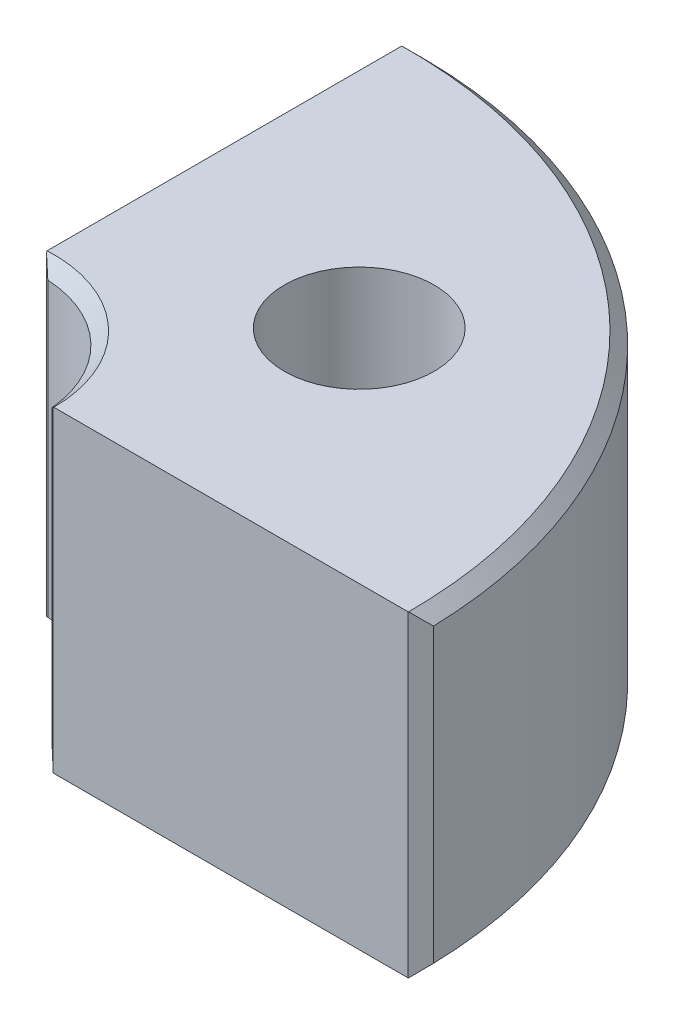
ISO-10303-21;
HEADER;
FILE_DESCRIPTION(('STEP AP214'),'2;1');
FILE_NAME('part.step','',(''),(''),'','','');
FILE_SCHEMA(('AUTOMOTIVE_DESIGN { 1 0 10303 214 1 1 1 1 }'));
ENDSEC;
DATA;
#1=APPLICATION_CONTEXT('core data for automotive mechanical design processes');
#2=APPLICATION_PROTOCOL_DEFINITION('international standard','automotive_design',2000,#1);
#3=PRODUCT_CONTEXT('',#1,'mechanical');
#4=PRODUCT('Part','Part','',(#3));
#5=PRODUCT_RELATED_PRODUCT_CATEGORY('part','',(#4));
#6=PRODUCT_DEFINITION_FORMATION('','',#4);
#7=PRODUCT_DEFINITION_CONTEXT('part definition',#1,'design');
#8=PRODUCT_DEFINITION('design','',#6,#7);
#9=PRODUCT_DEFINITION_SHAPE('','',#8);
#10=(LENGTH_UNIT() NAMED_UNIT(*) SI_UNIT(.MILLI.,.METRE.));
#11=(NAMED_UNIT(*) PLANE_ANGLE_UNIT() SI_UNIT($,.RADIAN.));
#12=(NAMED_UNIT(*) SI_UNIT($,.STERADIAN.) SOLID_ANGLE_UNIT());
#13=UNCERTAINTY_MEASURE_WITH_UNIT(LENGTH_MEASURE(1.E-05),#10,'distance_accuracy_value','');
#14=(GEOMETRIC_REPRESENTATION_CONTEXT(3) GLOBAL_UNCERTAINTY_ASSIGNED_CONTEXT((#13)) GLOBAL_UNIT_ASSIGNED_CONTEXT((#10,
#11,#12)) REPRESENTATION_CONTEXT('',''));
#15=CARTESIAN_POINT('',(0.,0.,0.));
#16=DIRECTION('',(0.,0.,1.));
#17=DIRECTION('',(1.,0.,0.));
#18=AXIS2_PLACEMENT_3D('',#15,#16,#17);
#19=CARTESIAN_POINT('',(0.,-127.,0.));
#20=DIRECTION('',(0.,1.,0.));
#21=DIRECTION('',(0.,0.,1.));
#22=AXIS2_PLACEMENT_3D('',#19,#20,#21);
#23=CYLINDRICAL_SURFACE('',#22,48.);
#24=CARTESIAN_POINT('',(0.,-5.00000000000005,0.));
#25=DIRECTION('',(0.,1.,0.));
#26=DIRECTION('',(0.,0.,1.));
#27=AXIS2_PLACEMENT_3D('',#24,#25,#26);
#28=CIRCLE('',#27,48.);
#29=CARTESIAN_POINT('',(47.7859234714792,-5.00000000000005,-4.5283018867925));
#30=VERTEX_POINT('',#29);
#31=CARTESIAN_POINT('',(2.68257943766785,-5.00000000000005,-47.9249806213899));
#32=VERTEX_POINT('',#31);
#33=EDGE_CURVE('E283',#30,#32,#28,.T.);
#34=ORIENTED_EDGE('',*,*,#33,.T.);
#35=DIRECTION('',(0.,1.,0.));
#36=VECTOR('',#35,1.);
#37=CARTESIAN_POINT('',(2.68257943766785,-127.,-47.9249806213899));
#38=LINE('',#37,#36);
#39=CARTESIAN_POINT('',(2.68257943766785,-122.,-47.9249806213899));
#40=VERTEX_POINT('',#39);
#41=EDGE_CURVE('E289',#32,#40,#38,.F.);
#42=ORIENTED_EDGE('',*,*,#41,.T.);
#43=CARTESIAN_POINT('',(0.,-122.,0.));
#44=DIRECTION('',(0.,1.,0.));
#45=DIRECTION('',(0.,0.,1.));
#46=AXIS2_PLACEMENT_3D('',#43,#44,#45);
#47=CIRCLE('',#46,48.);
#48=CARTESIAN_POINT('',(47.7859234714792,-122.,-4.5283018867925));
#49=VERTEX_POINT('',#48);
#50=EDGE_CURVE('E287',#40,#49,#47,.F.);
#51=ORIENTED_EDGE('',*,*,#50,.T.);
#52=DIRECTION('',(0.,1.,0.));
#53=VECTOR('',#52,1.);
#54=CARTESIAN_POINT('',(47.7859234714792,-127.,-4.5283018867925));
#55=LINE('',#54,#53);
#56=EDGE_CURVE('E285',#49,#30,#55,.T.);
#57=ORIENTED_EDGE('',*,*,#56,.T.);
#58=EDGE_LOOP('',(#34,#42,#51,#57));
#59=FACE_BOUND('',#58,.T.);
#60=ADVANCED_FACE('F35',(#59),#23,.F.);
#61=CARTESIAN_POINT('',(-2.61819612069647,-127.,-199.982861888397));
#62=DIRECTION('',(-1.,0.,0.));
#63=DIRECTION('',(0.,0.,1.));
#64=AXIS2_PLACEMENT_3D('',#61,#62,#63);
#65=PLANE('',#64);
#66=DIRECTION('',(0.,-1.,0.));
#67=VECTOR('',#66,1.);
#68=CARTESIAN_POINT('',(-2.61819612069647,-127.,-194.982861888397));
#69=LINE('',#68,#67);
#70=CARTESIAN_POINT('',(-2.61819612069647,-0.000439438263805103,-194.982861888397));
#71=VERTEX_POINT('',#70);
#72=CARTESIAN_POINT('',(-2.61819612069647,-126.999560561736,-194.982861888397));
#73=VERTEX_POINT('',#72);
#74=EDGE_CURVE('E138',#71,#73,#69,.T.);
#75=ORIENTED_EDGE('',*,*,#74,.T.);
#76=CARTESIAN_POINT('',(-2.61819612069647,-126.999560561736,-194.982861888397));
#77=CARTESIAN_POINT('',(-2.61819612069647,-126.999633801447,-194.982788642083));
#78=CARTESIAN_POINT('',(-2.61819612069647,-126.999707041157,-194.98271539577));
#79=CARTESIAN_POINT('',(-2.61819612069647,-126.999853520579,-194.982568903144));
#80=CARTESIAN_POINT('',(-2.61819612069647,-126.999926760289,-194.982495656831));
#81=CARTESIAN_POINT('',(-2.61819612069647,-127.,-194.982422410518));
#82=B_SPLINE_CURVE_WITH_KNOTS('',3,(#76,#77,#78,#79,#80,#81),.UNSPECIFIED.,.F.,.F.,(4,2,4),(0.,
0.000310743782614105,0.000621487565228213),.UNSPECIFIED.);
#83=CARTESIAN_POINT('',(-2.61819612069647,-127.,-194.982422410518));
#84=VERTEX_POINT('',#83);
#85=EDGE_CURVE('E277',#73,#84,#82,.T.);
#86=ORIENTED_EDGE('',*,*,#85,.T.);
#87=DIRECTION('',(0.,0.,1.));
#88=VECTOR('',#87,1.);
#89=CARTESIAN_POINT('',(-2.61819612069647,-127.,-199.982861888397));
#90=LINE('',#89,#88);
#91=CARTESIAN_POINT('',(-2.61819612069647,-127.,-52.9352911494172));
#92=VERTEX_POINT('',#91);
#93=EDGE_CURVE('E151',#84,#92,#90,.T.);
#94=ORIENTED_EDGE('',*,*,#93,.T.);
#95=CARTESIAN_POINT('',(-2.61819612069647,-127.,-52.9352911494172));
#96=CARTESIAN_POINT('',(-2.61819612069647,-126.956941242904,-52.8921797573179));
#97=CARTESIAN_POINT('',(-2.61819612069647,-126.913882550543,-52.8490683005629));
#98=CARTESIAN_POINT('',(-2.61819612069647,-126.827765295292,-52.7628452577417));
#99=CARTESIAN_POINT('',(-2.61819612069647,-126.784706732401,-52.7197336716754));
#100=CARTESIAN_POINT('',(-2.61819612069647,-126.741648234245,-52.6766220209536));
#101=B_SPLINE_CURVE_WITH_KNOTS('',3,(#95,#96,#97,#98,#99,#100),.UNSPECIFIED.,.F.,.F.,(4,2,4),
(0.,0.18279452459601,0.365589049192035),.UNSPECIFIED.);
#102=CARTESIAN_POINT('',(-2.61819612069647,-126.741648234245,-52.6766220209536));
#103=VERTEX_POINT('',#102);
#104=EDGE_CURVE('E221',#92,#103,#101,.T.);
#105=ORIENTED_EDGE('',*,*,#104,.T.);
#106=DIRECTION('',(0.,1.,0.));
#107=VECTOR('',#106,1.);
#108=CARTESIAN_POINT('',(-2.61819612069647,-127.,-52.6766220209536));
#109=LINE('',#108,#107);
#110=CARTESIAN_POINT('',(-2.61819612069647,-0.258351765754949,-52.6766220209536));
#111=VERTEX_POINT('',#110);
#112=EDGE_CURVE('E159',#103,#111,#109,.T.);
#113=ORIENTED_EDGE('',*,*,#112,.T.);
#114=CARTESIAN_POINT('',(-2.61819612069647,-0.258351765754949,-52.6766220209536));
#115=CARTESIAN_POINT('',(-2.61819612069647,-0.215293267599232,-52.7197336716754));
#116=CARTESIAN_POINT('',(-2.61819612069647,-0.172234704708461,-52.7628452577417));
#117=CARTESIAN_POINT('',(-2.61819612069647,-0.086117449456811,-52.8490683005629));
#118=CARTESIAN_POINT('',(-2.61819612069647,-0.0430587570959324,-52.8921797573179));
#119=CARTESIAN_POINT('',(-2.61819612069647,0.,-52.9352911494172));
#120=B_SPLINE_CURVE_WITH_KNOTS('',3,(#114,#115,#116,#117,#118,#119),.UNSPECIFIED.,.F.,.F.,(4,2,
4),(0.,0.182794524596019,0.365589049192035),.UNSPECIFIED.);
#121=CARTESIAN_POINT('',(-2.61819612069647,0.,-52.9352911494172));
#122=VERTEX_POINT('',#121);
#123=EDGE_CURVE('E157',#111,#122,#120,.T.);
#124=ORIENTED_EDGE('',*,*,#123,.T.);
#125=DIRECTION('',(0.,0.,1.));
#126=VECTOR('',#125,1.);
#127=CARTESIAN_POINT('',(-2.61819612069647,0.,-199.982861888397));
#128=LINE('',#127,#126);
#129=CARTESIAN_POINT('',(-2.61819612069647,0.,-194.982422410518));
#130=VERTEX_POINT('',#129);
#131=EDGE_CURVE('E310',#130,#122,#128,.T.);
#132=ORIENTED_EDGE('',*,*,#131,.F.);
#133=CARTESIAN_POINT('',(-2.61819612069647,0.,-194.982422410518));
#134=CARTESIAN_POINT('',(-2.61819612069647,-7.32397106311979E-05,-194.982495656831));
#135=CARTESIAN_POINT('',(-2.61819612069647,-0.000146479421262396,-194.982568903144));
#136=CARTESIAN_POINT('',(-2.61819612069647,-0.000292958842524792,-194.98271539577));
#137=CARTESIAN_POINT('',(-2.61819612069647,-0.000366198553155989,-194.982788642083));
#138=CARTESIAN_POINT('',(-2.61819612069647,-0.000439438263787187,-194.982861888397));
#139=B_SPLINE_CURVE_WITH_KNOTS('',3,(#133,#134,#135,#136,#137,#138),.UNSPECIFIED.,.F.,.F.,(4,2,
4),(0.,0.000310743782617586,0.000621487565235172),.UNSPECIFIED.);
#140=EDGE_CURVE('E227',#130,#71,#139,.T.);
#141=ORIENTED_EDGE('',*,*,#140,.T.);
#142=EDGE_LOOP('',(#75,#86,#94,#105,#113,#124,#132,#141));
#143=FACE_BOUND('',#142,.T.);
#144=ADVANCED_FACE('F171',(#143),#65,.T.);
#145=CARTESIAN_POINT('',(0.,-127.,0.));
#146=DIRECTION('',(0.,1.,0.));
#147=DIRECTION('',(0.,0.,1.));
#148=AXIS2_PLACEMENT_3D('',#145,#146,#147);
#149=CYLINDRICAL_SURFACE('',#148,200.);
#150=CARTESIAN_POINT('',(0.,-122.,0.));
#151=DIRECTION('',(0.,1.,0.));
#152=DIRECTION('',(0.,0.,1.));
#153=AXIS2_PLACEMENT_3D('',#150,#151,#152);
#154=CIRCLE('',#153,200.);
#155=CARTESIAN_POINT('',(199.93424297044,-122.,-5.12820512820508));
#156=VERTEX_POINT('',#155);
#157=CARTESIAN_POINT('',(2.38472421162988,-122.,-199.985782220723));
#158=VERTEX_POINT('',#157);
#159=EDGE_CURVE('E155',#156,#158,#154,.T.);
#160=ORIENTED_EDGE('',*,*,#159,.T.);
#161=DIRECTION('',(0.,1.,0.));
#162=VECTOR('',#161,1.);
#163=CARTESIAN_POINT('',(2.38472421162988,-127.,-199.985782220723));
#164=LINE('',#163,#162);
#165=CARTESIAN_POINT('',(2.38472421162988,-4.99999999999995,-199.985782220723));
#166=VERTEX_POINT('',#165);
#167=EDGE_CURVE('E136',#158,#166,#164,.T.);
#168=ORIENTED_EDGE('',*,*,#167,.T.);
#169=CARTESIAN_POINT('',(0.,-4.99999999999995,0.));
#170=DIRECTION('',(0.,1.,0.));
#171=DIRECTION('',(0.,0.,1.));
#172=AXIS2_PLACEMENT_3D('',#169,#170,#171);
#173=CIRCLE('',#172,200.);
#174=CARTESIAN_POINT('',(199.93424297044,-4.99999999999995,-5.12820512820508));
#175=VERTEX_POINT('',#174);
#176=EDGE_CURVE('E144',#166,#175,#173,.F.);
#177=ORIENTED_EDGE('',*,*,#176,.T.);
#178=DIRECTION('',(0.,1.,0.));
#179=VECTOR('',#178,1.);
#180=CARTESIAN_POINT('',(199.93424297044,-127.,-5.12820512820508));
#181=LINE('',#180,#179);
#182=EDGE_CURVE('E150',#175,#156,#181,.F.);
#183=ORIENTED_EDGE('',*,*,#182,.T.);
#184=EDGE_LOOP('',(#160,#168,#177,#183));
#185=FACE_BOUND('',#184,.T.);
#186=ADVANCED_FACE('F153',(#185),#149,.T.);
#187=CARTESIAN_POINT('',(48.,-127.,0.));
#188=DIRECTION('',(0.,0.,1.));
#189=DIRECTION('',(1.,0.,0.));
#190=AXIS2_PLACEMENT_3D('',#187,#188,#189);
#191=PLANE('',#190);
#192=DIRECTION('',(1.,0.,0.));
#193=VECTOR('',#192,1.);
#194=CARTESIAN_POINT('',(48.,-127.,0.));
#195=LINE('',#194,#193);
#196=CARTESIAN_POINT('',(53.,-127.,0.));
#197=VERTEX_POINT('',#196);
#198=CARTESIAN_POINT('',(194.935886896179,-127.,0.));
#199=VERTEX_POINT('',#198);
#200=EDGE_CURVE('E315',#197,#199,#195,.T.);
#201=ORIENTED_EDGE('',*,*,#200,.T.);
#202=DIRECTION('',(0.,1.,0.));
#203=VECTOR('',#202,1.);
#204=CARTESIAN_POINT('',(194.935886896179,-127.,0.));
#205=LINE('',#204,#203);
#206=CARTESIAN_POINT('',(194.935886896179,0.,0.));
#207=VERTEX_POINT('',#206);
#208=EDGE_CURVE('E303',#199,#207,#205,.T.);
#209=ORIENTED_EDGE('',*,*,#208,.T.);
#210=DIRECTION('',(1.,0.,0.));
#211=VECTOR('',#210,1.);
#212=CARTESIAN_POINT('',(48.,0.,0.));
#213=LINE('',#212,#211);
#214=CARTESIAN_POINT('',(53.,0.,0.));
#215=VERTEX_POINT('',#214);
#216=EDGE_CURVE('E316',#215,#207,#213,.T.);
#217=ORIENTED_EDGE('',*,*,#216,.F.);
#218=DIRECTION('',(0.707106781186546,0.707106781186549,0.));
#219=VECTOR('',#218,1.);
#220=CARTESIAN_POINT('',(0.,-53.0000000000002,0.));
#221=LINE('',#220,#219);
#222=CARTESIAN_POINT('',(52.7636238330917,-0.236376166908331,0.));
#223=VERTEX_POINT('',#222);
#224=EDGE_CURVE('E298',#215,#223,#221,.F.);
#225=ORIENTED_EDGE('',*,*,#224,.T.);
#226=DIRECTION('',(0.,-1.,0.));
#227=VECTOR('',#226,1.);
#228=CARTESIAN_POINT('',(52.7636238330917,-127.,0.));
#229=LINE('',#228,#227);
#230=CARTESIAN_POINT('',(52.7636238330917,-126.763623833092,0.));
#231=VERTEX_POINT('',#230);
#232=EDGE_CURVE('E64',#223,#231,#229,.T.);
#233=ORIENTED_EDGE('',*,*,#232,.T.);
#234=DIRECTION('',(-0.707106781186546,0.707106781186549,0.));
#235=VECTOR('',#234,1.);
#236=CARTESIAN_POINT('',(0.,-73.9999999999998,0.));
#237=LINE('',#236,#235);
#238=EDGE_CURVE('E301',#231,#197,#237,.F.);
#239=ORIENTED_EDGE('',*,*,#238,.T.);
#240=EDGE_LOOP('',(#201,#209,#217,#225,#233,#239));
#241=FACE_BOUND('',#240,.T.);
#242=ADVANCED_FACE('F353',(#241),#191,.T.);
#243=CARTESIAN_POINT('',(0.,-127.,0.));
#244=DIRECTION('',(0.,1.,0.));
#245=DIRECTION('',(0.,0.,1.));
#246=AXIS2_PLACEMENT_3D('',#243,#244,#245);
#247=PLANE('',#246);
#248=CARTESIAN_POINT('',(86.7388556420205,-127.,-88.5903030924198));
#249=DIRECTION('',(0.,1.,0.));
#250=DIRECTION('',(0.,0.,1.));
#251=AXIS2_PLACEMENT_3D('',#248,#249,#250);
#252=CIRCLE('',#251,30.);
#253=CARTESIAN_POINT('',(86.7388556420205,-127.,-58.5903030924198));
#254=VERTEX_POINT('',#253);
#255=EDGE_CURVE('E320',#254,#254,#252,.T.);
#256=ORIENTED_EDGE('',*,*,#255,.T.);
#257=EDGE_LOOP('',(#256));
#258=FACE_BOUND('',#257,.T.);
#259=ORIENTED_EDGE('',*,*,#93,.F.);
#260=CARTESIAN_POINT('',(0.,-127.,0.));
#261=DIRECTION('',(0.,1.,0.));
#262=DIRECTION('',(0.,0.,1.));
#263=AXIS2_PLACEMENT_3D('',#260,#261,#262);
#264=CIRCLE('',#263,195.);
#265=CARTESIAN_POINT('',(194.999988909397,-127.,-0.0657672778869932));
#266=VERTEX_POINT('',#265);
#267=EDGE_CURVE('E296',#84,#266,#264,.F.);
#268=ORIENTED_EDGE('',*,*,#267,.T.);
#269=DIRECTION('',(0.697982440452114,0.,-0.716114874039432));
#270=VECTOR('',#269,1.);
#271=CARTESIAN_POINT('',(194.935886896179,-127.,0.));
#272=LINE('',#271,#270);
#273=EDGE_CURVE('E294',#266,#199,#272,.F.);
#274=ORIENTED_EDGE('',*,*,#273,.T.);
#275=ORIENTED_EDGE('',*,*,#200,.F.);
#276=CARTESIAN_POINT('',(0.,-127.,0.));
#277=DIRECTION('',(0.,1.,0.));
#278=DIRECTION('',(0.,0.,1.));
#279=AXIS2_PLACEMENT_3D('',#276,#277,#278);
#280=CIRCLE('',#279,53.);
#281=EDGE_CURVE('E292',#197,#92,#280,.T.);
#282=ORIENTED_EDGE('',*,*,#281,.T.);
#283=EDGE_LOOP('',(#259,#268,#274,#275,#282));
#284=FACE_BOUND('',#283,.T.);
#285=ADVANCED_FACE('F333',(#258,#284),#247,.F.);
#286=CARTESIAN_POINT('',(0.,0.,0.));
#287=DIRECTION('',(0.,1.,0.));
#288=DIRECTION('',(0.,0.,1.));
#289=AXIS2_PLACEMENT_3D('',#286,#287,#288);
#290=PLANE('',#289);
#291=CARTESIAN_POINT('',(86.7388556420205,0.,-88.5903030924198));
#292=DIRECTION('',(0.,1.,0.));
#293=DIRECTION('',(0.,0.,1.));
#294=AXIS2_PLACEMENT_3D('',#291,#292,#293);
#295=CIRCLE('',#294,30.);
#296=CARTESIAN_POINT('',(86.7388556420205,0.,-58.5903030924198));
#297=VERTEX_POINT('',#296);
#298=EDGE_CURVE('E268',#297,#297,#295,.T.);
#299=ORIENTED_EDGE('',*,*,#298,.F.);
#300=EDGE_LOOP('',(#299));
#301=FACE_BOUND('',#300,.T.);
#302=ORIENTED_EDGE('',*,*,#216,.T.);
#303=DIRECTION('',(-0.697982440452114,0.,0.716114874039432));
#304=VECTOR('',#303,1.);
#305=CARTESIAN_POINT('',(99.9671214852199,0.,97.4358974358974));
#306=LINE('',#305,#304);
#307=CARTESIAN_POINT('',(194.999988909397,0.,-0.0657672778869648));
#308=VERTEX_POINT('',#307);
#309=EDGE_CURVE('E11',#207,#308,#306,.F.);
#310=ORIENTED_EDGE('',*,*,#309,.T.);
#311=CARTESIAN_POINT('',(0.,0.,0.));
#312=DIRECTION('',(0.,1.,0.));
#313=DIRECTION('',(0.,0.,1.));
#314=AXIS2_PLACEMENT_3D('',#311,#312,#313);
#315=CIRCLE('',#314,195.);
#316=EDGE_CURVE('E50',#308,#130,#315,.T.);
#317=ORIENTED_EDGE('',*,*,#316,.T.);
#318=ORIENTED_EDGE('',*,*,#131,.T.);
#319=CARTESIAN_POINT('',(0.,0.,0.));
#320=DIRECTION('',(0.,1.,0.));
#321=DIRECTION('',(0.,0.,1.));
#322=AXIS2_PLACEMENT_3D('',#319,#320,#321);
#323=CIRCLE('',#322,53.);
#324=EDGE_CURVE('E305',#122,#215,#323,.F.);
#325=ORIENTED_EDGE('',*,*,#324,.T.);
#326=EDGE_LOOP('',(#302,#310,#317,#318,#325));
#327=FACE_BOUND('',#326,.T.);
#328=ADVANCED_FACE('F309',(#301,#327),#290,.T.);
#329=CARTESIAN_POINT('',(86.7388556420205,-127.,-88.5903030924198));
#330=DIRECTION('',(0.,1.,0.));
#331=DIRECTION('',(0.,0.,1.));
#332=AXIS2_PLACEMENT_3D('',#329,#330,#331);
#333=CYLINDRICAL_SURFACE('',#332,30.);
#334=ORIENTED_EDGE('',*,*,#255,.F.);
#335=EDGE_LOOP('',(#334));
#336=FACE_BOUND('',#335,.T.);
#337=ORIENTED_EDGE('',*,*,#298,.T.);
#338=EDGE_LOOP('',(#337));
#339=FACE_BOUND('',#338,.T.);
#340=ADVANCED_FACE('F343',(#336,#339),#333,.F.);
#341=CARTESIAN_POINT('',(194.935886896179,-127.,0.));
#342=DIRECTION('',(-0.716114874039432,0.,-0.697982440452114));
#343=DIRECTION('',(0.,1.,0.));
#344=AXIS2_PLACEMENT_3D('',#341,#342,#343);
#345=PLANE('',#344);
#346=ORIENTED_EDGE('',*,*,#208,.F.);
#347=ORIENTED_EDGE('',*,*,#273,.F.);
#348=CARTESIAN_POINT('',(194.999988909397,-127.,-0.0657672778869932));
#349=CARTESIAN_POINT('',(195.412937033083,-126.586908646135,-0.489443113322181));
#350=CARTESIAN_POINT('',(195.825433210064,-126.172890248044,-0.912655261222494));
#351=CARTESIAN_POINT('',(196.649536606926,-125.3430524616,-1.75816750628351));
#352=CARTESIAN_POINT('',(197.061143834675,-124.927233089284,-2.18046761151571));
#353=CARTESIAN_POINT('',(197.883491469298,-124.093839249565,-3.0241784825269));
#354=CARTESIAN_POINT('',(198.294231876464,-123.676264782754,-3.44558924860592));
#355=CARTESIAN_POINT('',(199.114867639095,-122.839403797579,-4.28754377601261));
#356=CARTESIAN_POINT('',(199.524762987019,-122.420117264034,-4.70808752960235));
#357=CARTESIAN_POINT('',(199.93424297044,-122.,-5.12820512820507));
#358=B_SPLINE_CURVE_WITH_KNOTS('',3,(#348,#349,#350,#351,#352,#353,#354,#355,#356,#357),
.UNSPECIFIED.,.F.,.F.,(4,2,2,2,4),(0.,2.16472666625088,4.32943409568699,6.49414079469575,
8.65886673037086),.UNSPECIFIED.);
#359=EDGE_CURVE('E258',#156,#266,#358,.F.);
#360=ORIENTED_EDGE('',*,*,#359,.F.);
#361=ORIENTED_EDGE('',*,*,#182,.F.);
#362=CARTESIAN_POINT('',(194.999988909397,0.,-0.0657672778869648));
#363=CARTESIAN_POINT('',(195.412937033083,-0.413091353864836,-0.489443113322158));
#364=CARTESIAN_POINT('',(195.825433210064,-0.82710975195554,-0.912655261222477));
#365=CARTESIAN_POINT('',(196.649536606926,-1.65694753839952,-1.7581675062835));
#366=CARTESIAN_POINT('',(197.061143834675,-2.07276691071563,-2.1804676115157));
#367=CARTESIAN_POINT('',(197.883491469298,-2.90616075043525,-3.0241784825269));
#368=CARTESIAN_POINT('',(198.294231876464,-3.32373521724649,-3.44558924860592));
#369=CARTESIAN_POINT('',(199.114867639095,-4.16059620242143,-4.28754377601261));
#370=CARTESIAN_POINT('',(199.524762987019,-4.57988273596629,-4.70808752960236));
#371=CARTESIAN_POINT('',(199.93424297044,-4.99999999999996,-5.12820512820507));
#372=B_SPLINE_CURVE_WITH_KNOTS('',3,(#362,#363,#364,#365,#366,#367,#368,#369,#370,#371),
.UNSPECIFIED.,.F.,.F.,(4,2,2,2,4),(0.,2.16472666625089,4.32943409568702,6.49414079469578,
8.6588667303709),.UNSPECIFIED.);
#373=EDGE_CURVE('E147',#308,#175,#372,.T.);
#374=ORIENTED_EDGE('',*,*,#373,.F.);
#375=ORIENTED_EDGE('',*,*,#309,.F.);
#376=EDGE_LOOP('',(#346,#347,#360,#361,#374,#375));
#377=FACE_BOUND('',#376,.T.);
#378=ADVANCED_FACE('F188',(#377),#345,.F.);
#379=CARTESIAN_POINT('',(0.,-122.,0.));
#380=DIRECTION('',(0.,1.,0.));
#381=DIRECTION('',(0.,0.,1.));
#382=AXIS2_PLACEMENT_3D('',#379,#380,#381);
#383=CONICAL_SURFACE('',#382,200.,0.785398163397451);
#384=ORIENTED_EDGE('',*,*,#267,.F.);
#385=ORIENTED_EDGE('',*,*,#85,.F.);
#386=CARTESIAN_POINT('',(-2.61819612069647,-126.999560561736,-194.982861888397));
#387=CARTESIAN_POINT('',(-2.19949708498547,-126.586520616592,-195.401560924108));
#388=CARTESIAN_POINT('',(-1.78125736543306,-126.172549769697,-195.81980064366));
#389=CARTESIAN_POINT('',(-0.945681398964447,-125.34279963182,-196.655376610129));
#390=CARTESIAN_POINT('',(-0.528345144000101,-124.927020357047,-197.072712865093));
#391=CARTESIAN_POINT('',(0.305446401250749,-124.093699473263,-197.906504410344));
#392=CARTESIAN_POINT('',(0.721901691836459,-123.676157864849,-198.32295970093));
#393=CARTESIAN_POINT('',(1.55395344562826,-122.839355556599,-199.155011454721));
#394=CARTESIAN_POINT('',(1.96954990111877,-122.420094841418,-199.570607910212));
#395=CARTESIAN_POINT('',(2.38472421162989,-122.,-199.985782220723));
#396=B_SPLINE_CURVE_WITH_KNOTS('',3,(#386,#387,#388,#389,#390,#391,#392,#393,#394,#395),
.UNSPECIFIED.,.F.,.F.,(4,2,2,2,4),(0.,2.16586538253742,4.33171139129895,6.49755666434765,
8.66342131102249),.UNSPECIFIED.);
#397=EDGE_CURVE('E141',#158,#73,#396,.F.);
#398=ORIENTED_EDGE('',*,*,#397,.F.);
#399=ORIENTED_EDGE('',*,*,#159,.F.);
#400=ORIENTED_EDGE('',*,*,#359,.T.);
#401=EDGE_LOOP('',(#384,#385,#398,#399,#400));
#402=FACE_BOUND('',#401,.T.);
#403=ADVANCED_FACE('F243',(#402),#383,.T.);
#404=CARTESIAN_POINT('',(0.,0.,0.));
#405=DIRECTION('',(0.,-1.,0.));
#406=DIRECTION('',(0.,0.,-1.));
#407=AXIS2_PLACEMENT_3D('',#404,#405,#406);
#408=CONICAL_SURFACE('',#407,195.,0.785398163397451);
#409=ORIENTED_EDGE('',*,*,#373,.T.);
#410=ORIENTED_EDGE('',*,*,#176,.F.);
#411=CARTESIAN_POINT('',(2.38472421162988,-4.99999999999995,-199.985782220723));
#412=CARTESIAN_POINT('',(1.96954990111877,-4.5799051585821,-199.570607910212));
#413=CARTESIAN_POINT('',(1.55395344562827,-4.16064444340141,-199.155011454721));
#414=CARTESIAN_POINT('',(0.721901691836462,-3.32384213515095,-198.32295970093));
#415=CARTESIAN_POINT('',(0.305446401250753,-2.9063005267372,-197.906504410344));
#416=CARTESIAN_POINT('',(-0.5283451440001,-2.07297964295254,-197.072712865093));
#417=CARTESIAN_POINT('',(-0.945681398964447,-1.65720036818031,-196.655376610129));
#418=CARTESIAN_POINT('',(-1.78125736543306,-0.827450230303188,-195.81980064366));
#419=CARTESIAN_POINT('',(-2.19949708498547,-0.413479383408039,-195.401560924108));
#420=CARTESIAN_POINT('',(-2.61819612069646,-0.000439438263801672,-194.982861888397));
#421=B_SPLINE_CURVE_WITH_KNOTS('',3,(#411,#412,#413,#414,#415,#416,#417,#418,#419,#420),
.UNSPECIFIED.,.F.,.F.,(4,2,2,2,4),(0.,2.16586464667485,4.33170991972356,6.49755592848509,
8.66342131102251),.UNSPECIFIED.);
#422=EDGE_CURVE('E132',#71,#166,#421,.F.);
#423=ORIENTED_EDGE('',*,*,#422,.F.);
#424=ORIENTED_EDGE('',*,*,#140,.F.);
#425=ORIENTED_EDGE('',*,*,#316,.F.);
#426=EDGE_LOOP('',(#409,#410,#423,#424,#425));
#427=FACE_BOUND('',#426,.T.);
#428=ADVANCED_FACE('F145',(#427),#408,.T.);
#429=CARTESIAN_POINT('',(2.38472421162991,-127.,-199.985782220723));
#430=DIRECTION('',(0.70710678118655,0.,0.707106781186546));
#431=DIRECTION('',(0.,1.,0.));
#432=AXIS2_PLACEMENT_3D('',#429,#430,#431);
#433=PLANE('',#432);
#434=ORIENTED_EDGE('',*,*,#397,.T.);
#435=ORIENTED_EDGE('',*,*,#74,.F.);
#436=ORIENTED_EDGE('',*,*,#422,.T.);
#437=ORIENTED_EDGE('',*,*,#167,.F.);
#438=EDGE_LOOP('',(#434,#435,#436,#437));
#439=FACE_BOUND('',#438,.T.);
#440=ADVANCED_FACE('F134',(#439),#433,.F.);
#441=CARTESIAN_POINT('',(47.7859234714792,-127.,-4.5283018867925));
#442=DIRECTION('',(0.672926584910455,0.,-0.739709274864627));
#443=DIRECTION('',(0.,1.,0.));
#444=AXIS2_PLACEMENT_3D('',#441,#442,#443);
#445=PLANE('',#444);
#446=CARTESIAN_POINT('',(47.7859234714792,-5.00000000000005,-4.5283018867925));
#447=CARTESIAN_POINT('',(48.2076305845834,-4.61634581718887,-4.14466748190339));
#448=CARTESIAN_POINT('',(48.6274407696124,-4.22889963610578,-3.76275874596944));
#449=CARTESIAN_POINT('',(49.4634889073918,-3.44717128231353,-3.00219099686334));
#450=CARTESIAN_POINT('',(49.879727294432,-3.05288995880357,-2.62353158861024));
#451=CARTESIAN_POINT('',(50.7089501247911,-2.25815126741819,-1.8691729421468));
#452=CARTESIAN_POINT('',(51.1219346248495,-1.85769400759701,-1.49347365231959));
#453=CARTESIAN_POINT('',(51.9449485578381,-1.05112249953174,-0.744763349395332));
#454=CARTESIAN_POINT('',(52.3549776200385,-0.645007559702564,-0.371752673557845));
#455=CARTESIAN_POINT('',(52.7636238330917,-0.236376166908333,0.));
#456=B_SPLINE_CURVE_WITH_KNOTS('',3,(#446,#447,#448,#449,#450,#451,#452,#453,#454,#455),
.UNSPECIFIED.,.F.,.F.,(4,2,2,2,4),(0.,2.0614801344574,4.1227059601974,6.18389576353346,
8.24533977332517),.UNSPECIFIED.);
#457=EDGE_CURVE('E202',#30,#223,#456,.T.);
#458=ORIENTED_EDGE('',*,*,#457,.F.);
#459=ORIENTED_EDGE('',*,*,#56,.F.);
#460=CARTESIAN_POINT('',(47.7859234714792,-122.,-4.5283018867925));
#461=CARTESIAN_POINT('',(48.2076305845834,-122.383654182811,-4.1446674819034));
#462=CARTESIAN_POINT('',(48.6274407696124,-122.771100363894,-3.76275874596944));
#463=CARTESIAN_POINT('',(49.4634889073918,-123.552828717686,-3.00219099686334));
#464=CARTESIAN_POINT('',(49.879727294432,-123.947110041196,-2.62353158861024));
#465=CARTESIAN_POINT('',(50.7089501247911,-124.741848732582,-1.8691729421468));
#466=CARTESIAN_POINT('',(51.1219346248495,-125.142305992403,-1.49347365231959));
#467=CARTESIAN_POINT('',(51.9449485578381,-125.948877500468,-0.744763349395335));
#468=CARTESIAN_POINT('',(52.3549776200385,-126.354992440297,-0.371752673557849));
#469=CARTESIAN_POINT('',(52.7636238330917,-126.763623833092,0.));
#470=B_SPLINE_CURVE_WITH_KNOTS('',3,(#460,#461,#462,#463,#464,#465,#466,#467,#468,#469),
.UNSPECIFIED.,.F.,.F.,(4,2,2,2,4),(0.,2.06148013445739,4.1227059601974,6.18389576353346,
8.24533977332517),.UNSPECIFIED.);
#471=EDGE_CURVE('E41',#231,#49,#470,.F.);
#472=ORIENTED_EDGE('',*,*,#471,.F.);
#473=ORIENTED_EDGE('',*,*,#232,.F.);
#474=EDGE_LOOP('',(#458,#459,#472,#473));
#475=FACE_BOUND('',#474,.T.);
#476=ADVANCED_FACE('F38',(#475),#445,.F.);
#477=CARTESIAN_POINT('',(0.,-122.,0.));
#478=DIRECTION('',(0.,-1.,0.));
#479=DIRECTION('',(0.,0.,-1.));
#480=AXIS2_PLACEMENT_3D('',#477,#478,#479);
#481=CONICAL_SURFACE('',#480,48.,0.785398163397446);
#482=ORIENTED_EDGE('',*,*,#471,.T.);
#483=ORIENTED_EDGE('',*,*,#50,.F.);
#484=CARTESIAN_POINT('',(2.68257943766785,-122.,-47.9249806213899));
#485=CARTESIAN_POINT('',(2.23236619643162,-122.377806887026,-48.3285539951605));
#486=CARTESIAN_POINT('',(1.78447698818539,-122.760576615444,-48.7300440942767));
#487=CARTESIAN_POINT('',(0.893102700910755,-123.535019396568,-49.5290764093193));
#488=CARTESIAN_POINT('',(0.449616819364668,-123.926690782479,-49.9266193446264));
#489=CARTESIAN_POINT('',(-0.433350022168466,-124.718045060468,-50.7181151837684));
#490=CARTESIAN_POINT('',(-0.87283108816087,-125.11772773959,-51.1120681826269));
#491=CARTESIAN_POINT('',(-1.74817509886553,-125.924411007803,-51.8967308785529));
#492=CARTESIAN_POINT('',(-2.18403735659173,-126.331412941945,-52.2874399598025));
#493=CARTESIAN_POINT('',(-2.61819612069647,-126.741648234245,-52.6766220209536));
#494=B_SPLINE_CURVE_WITH_KNOTS('',3,(#484,#485,#486,#487,#488,#489,#490,#491,#492,#493),
.UNSPECIFIED.,.F.,.F.,(4,2,2,2,4),(0.,2.13880948469577,4.27722173386941,6.41557721501684,
8.55432975804189),.UNSPECIFIED.);
#495=EDGE_CURVE('E208',#103,#40,#494,.F.);
#496=ORIENTED_EDGE('',*,*,#495,.F.);
#497=ORIENTED_EDGE('',*,*,#104,.F.);
#498=ORIENTED_EDGE('',*,*,#281,.F.);
#499=ORIENTED_EDGE('',*,*,#238,.F.);
#500=EDGE_LOOP('',(#482,#483,#496,#497,#498,#499));
#501=FACE_BOUND('',#500,.T.);
#502=ADVANCED_FACE('F185',(#501),#481,.F.);
#503=CARTESIAN_POINT('',(0.,0.,0.));
#504=DIRECTION('',(0.,1.,0.));
#505=DIRECTION('',(0.,0.,1.));
#506=AXIS2_PLACEMENT_3D('',#503,#504,#505);
#507=CONICAL_SURFACE('',#506,53.,0.785398163397446);
#508=ORIENTED_EDGE('',*,*,#324,.F.);
#509=ORIENTED_EDGE('',*,*,#123,.F.);
#510=CARTESIAN_POINT('',(-2.61819612069647,-0.258351765754951,-52.6766220209536));
#511=CARTESIAN_POINT('',(-2.18403735659173,-0.668587058054607,-52.2874399598025));
#512=CARTESIAN_POINT('',(-1.74817509886553,-1.07558899219666,-51.8967308785529));
#513=CARTESIAN_POINT('',(-0.872831088160872,-1.88227226041014,-51.1120681826269));
#514=CARTESIAN_POINT('',(-0.433350022168471,-2.28195493953153,-50.7181151837684));
#515=CARTESIAN_POINT('',(0.449616819364662,-3.07330921752052,-49.9266193446264));
#516=CARTESIAN_POINT('',(0.893102700910752,-3.46498060343214,-49.5290764093193));
#517=CARTESIAN_POINT('',(1.78447698818539,-4.23942338455642,-48.7300440942767));
#518=CARTESIAN_POINT('',(2.23236619643162,-4.6221931129743,-48.3285539951605));
#519=CARTESIAN_POINT('',(2.68257943766785,-5.00000000000004,-47.9249806213899));
#520=B_SPLINE_CURVE_WITH_KNOTS('',3,(#510,#511,#512,#513,#514,#515,#516,#517,#518,#519),
.UNSPECIFIED.,.F.,.F.,(4,2,2,2,4),(0.,2.13875254302505,4.27710802417247,6.41552027334612,
8.5543297580419),.UNSPECIFIED.);
#521=EDGE_CURVE('E195',#32,#111,#520,.F.);
#522=ORIENTED_EDGE('',*,*,#521,.F.);
#523=ORIENTED_EDGE('',*,*,#33,.F.);
#524=ORIENTED_EDGE('',*,*,#457,.T.);
#525=ORIENTED_EDGE('',*,*,#224,.F.);
#526=EDGE_LOOP('',(#508,#509,#522,#523,#524,#525));
#527=FACE_BOUND('',#526,.T.);
#528=ADVANCED_FACE('F176',(#527),#507,.F.);
#529=CARTESIAN_POINT('',(-2.61819612069647,-127.,-52.6766220209536));
#530=DIRECTION('',(0.66748442023685,0.,-0.744623763212722));
#531=DIRECTION('',(0.,1.,0.));
#532=AXIS2_PLACEMENT_3D('',#529,#530,#531);
#533=PLANE('',#532);
#534=ORIENTED_EDGE('',*,*,#495,.T.);
#535=ORIENTED_EDGE('',*,*,#41,.F.);
#536=ORIENTED_EDGE('',*,*,#521,.T.);
#537=ORIENTED_EDGE('',*,*,#112,.F.);
#538=EDGE_LOOP('',(#534,#535,#536,#537));
#539=FACE_BOUND('',#538,.T.);
#540=ADVANCED_FACE('F184',(#539),#533,.F.);
#541=CLOSED_SHELL('',(#60,#144,#186,#242,#285,#328,#340,#378,#403,#428,#440,#476,#502,#528,#540));
#542=MANIFOLD_SOLID_BREP('B2',#541);
#543=ADVANCED_BREP_SHAPE_REPRESENTATION('',(#18,#542),#14);
#544=SHAPE_DEFINITION_REPRESENTATION(#9,#543);
ENDSEC;
END-ISO-10303-21;
